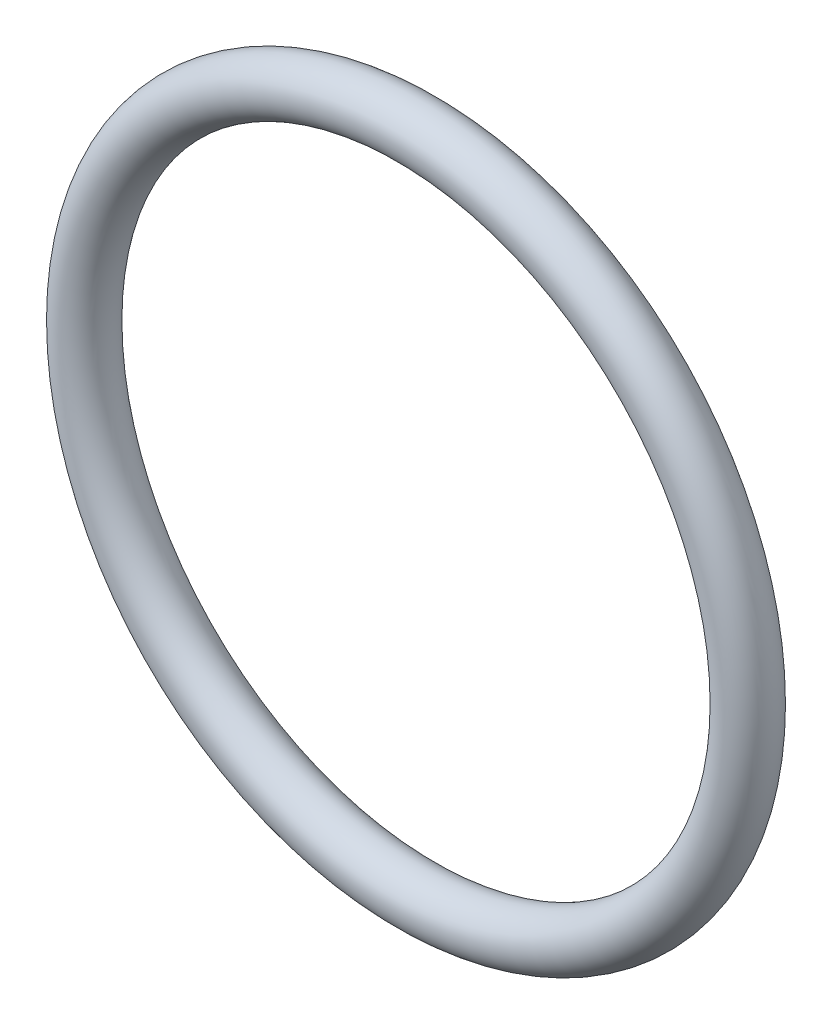
ISO-10303-21;
HEADER;
FILE_DESCRIPTION(('STEP AP214'),'2;1');
FILE_NAME('part.step','',(''),(''),'','','');
FILE_SCHEMA(('AUTOMOTIVE_DESIGN { 1 0 10303 214 1 1 1 1 }'));
ENDSEC;
DATA;
#1=APPLICATION_CONTEXT('core data for automotive mechanical design processes');
#2=APPLICATION_PROTOCOL_DEFINITION('international standard','automotive_design',2000,#1);
#3=PRODUCT_CONTEXT('',#1,'mechanical');
#4=PRODUCT('Part','Part','',(#3));
#5=PRODUCT_RELATED_PRODUCT_CATEGORY('part','',(#4));
#6=PRODUCT_DEFINITION_FORMATION('','',#4);
#7=PRODUCT_DEFINITION_CONTEXT('part definition',#1,'design');
#8=PRODUCT_DEFINITION('design','',#6,#7);
#9=PRODUCT_DEFINITION_SHAPE('','',#8);
#10=(LENGTH_UNIT() NAMED_UNIT(*) SI_UNIT(.MILLI.,.METRE.));
#11=(NAMED_UNIT(*) PLANE_ANGLE_UNIT() SI_UNIT($,.RADIAN.));
#12=(NAMED_UNIT(*) SI_UNIT($,.STERADIAN.) SOLID_ANGLE_UNIT());
#13=UNCERTAINTY_MEASURE_WITH_UNIT(LENGTH_MEASURE(1.E-05),#10,'distance_accuracy_value','');
#14=(GEOMETRIC_REPRESENTATION_CONTEXT(3) GLOBAL_UNCERTAINTY_ASSIGNED_CONTEXT((#13)) GLOBAL_UNIT_ASSIGNED_CONTEXT((#10,
#11,#12)) REPRESENTATION_CONTEXT('',''));
#15=CARTESIAN_POINT('',(0.,0.,0.));
#16=DIRECTION('',(0.,0.,1.));
#17=DIRECTION('',(1.,0.,0.));
#18=AXIS2_PLACEMENT_3D('',#15,#16,#17);
#19=CARTESIAN_POINT('',(0.,0.,0.));
#20=DIRECTION('',(0.,0.,1.));
#21=DIRECTION('',(1.,0.,0.));
#22=AXIS2_PLACEMENT_3D('',#19,#20,#21);
#23=TOROIDAL_SURFACE('',#22,11.0617,0.888999999999998);
#24=CARTESIAN_POINT('',(11.9507,0.,0.));
#25=VERTEX_POINT('',#24);
#26=VERTEX_LOOP('',#25);
#27=FACE_BOUND('',#26,.T.);
#28=ADVANCED_FACE('F35',(#27),#23,.T.);
#29=CLOSED_SHELL('',(#28));
#30=MANIFOLD_SOLID_BREP('B2',#29);
#31=ADVANCED_BREP_SHAPE_REPRESENTATION('',(#18,#30),#14);
#32=SHAPE_DEFINITION_REPRESENTATION(#9,#31);
ENDSEC;
END-ISO-10303-21;
